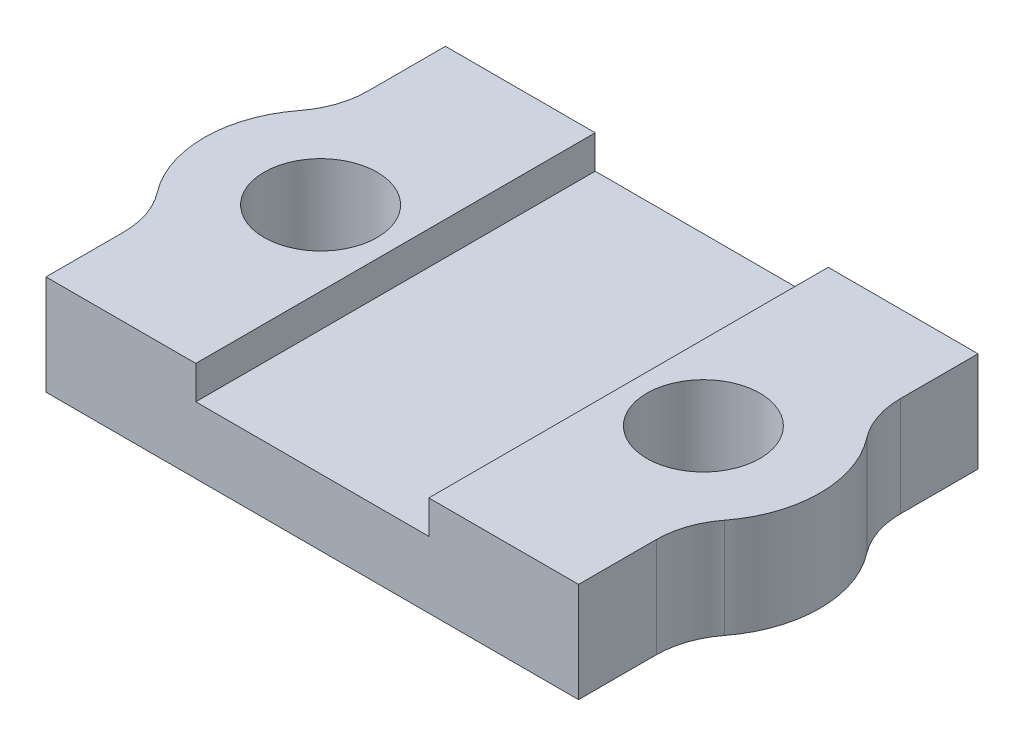
ISO-10303-21;
HEADER;
FILE_DESCRIPTION(('STEP AP214'),'2;1');
FILE_NAME('part.step','',(''),(''),'','','');
FILE_SCHEMA(('AUTOMOTIVE_DESIGN { 1 0 10303 214 1 1 1 1 }'));
ENDSEC;
DATA;
#1=APPLICATION_CONTEXT('core data for automotive mechanical design processes');
#2=APPLICATION_PROTOCOL_DEFINITION('international standard','automotive_design',2000,#1);
#3=PRODUCT_CONTEXT('',#1,'mechanical');
#4=PRODUCT('Part','Part','',(#3));
#5=PRODUCT_RELATED_PRODUCT_CATEGORY('part','',(#4));
#6=PRODUCT_DEFINITION_FORMATION('','',#4);
#7=PRODUCT_DEFINITION_CONTEXT('part definition',#1,'design');
#8=PRODUCT_DEFINITION('design','',#6,#7);
#9=PRODUCT_DEFINITION_SHAPE('','',#8);
#10=(LENGTH_UNIT() NAMED_UNIT(*) SI_UNIT(.MILLI.,.METRE.));
#11=(NAMED_UNIT(*) PLANE_ANGLE_UNIT() SI_UNIT($,.RADIAN.));
#12=(NAMED_UNIT(*) SI_UNIT($,.STERADIAN.) SOLID_ANGLE_UNIT());
#13=UNCERTAINTY_MEASURE_WITH_UNIT(LENGTH_MEASURE(1.E-05),#10,'distance_accuracy_value','');
#14=(GEOMETRIC_REPRESENTATION_CONTEXT(3) GLOBAL_UNCERTAINTY_ASSIGNED_CONTEXT((#13)) GLOBAL_UNIT_ASSIGNED_CONTEXT((#10,
#11,#12)) REPRESENTATION_CONTEXT('',''));
#15=CARTESIAN_POINT('',(0.,0.,0.));
#16=DIRECTION('',(0.,0.,1.));
#17=DIRECTION('',(1.,0.,0.));
#18=AXIS2_PLACEMENT_3D('',#15,#16,#17);
#19=CARTESIAN_POINT('',(10.5,2.,-3.6657195746538));
#20=DIRECTION('',(0.,1.,0.));
#21=DIRECTION('',(0.,0.,1.));
#22=AXIS2_PLACEMENT_3D('',#19,#20,#21);
#23=PLANE('',#22);
#24=DIRECTION('',(0.,0.,1.));
#25=VECTOR('',#24,1.);
#26=CARTESIAN_POINT('',(-3.5,2.,6.00000000000001));
#27=LINE('',#26,#25);
#28=CARTESIAN_POINT('',(-3.5,2.,-5.99999999999999));
#29=VERTEX_POINT('',#28);
#30=CARTESIAN_POINT('',(-3.5,2.,6.00000000000001));
#31=VERTEX_POINT('',#30);
#32=EDGE_CURVE('E170',#29,#31,#27,.T.);
#33=ORIENTED_EDGE('',*,*,#32,.T.);
#34=DIRECTION('',(1.,0.,0.));
#35=VECTOR('',#34,1.);
#36=CARTESIAN_POINT('',(-8.,2.,6.00000000000001));
#37=LINE('',#36,#35);
#38=CARTESIAN_POINT('',(3.5,2.,6.00000000000001));
#39=VERTEX_POINT('',#38);
#40=EDGE_CURVE('E37',#31,#39,#37,.T.);
#41=ORIENTED_EDGE('',*,*,#40,.T.);
#42=DIRECTION('',(0.,0.,1.));
#43=VECTOR('',#42,1.);
#44=CARTESIAN_POINT('',(3.5,2.,6.00000000000001));
#45=LINE('',#44,#43);
#46=CARTESIAN_POINT('',(3.5,2.,-6.));
#47=VERTEX_POINT('',#46);
#48=EDGE_CURVE('E56',#47,#39,#45,.T.);
#49=ORIENTED_EDGE('',*,*,#48,.F.);
#50=DIRECTION('',(-1.,0.,0.));
#51=VECTOR('',#50,1.);
#52=CARTESIAN_POINT('',(-8.,2.,-5.99999999999999));
#53=LINE('',#52,#51);
#54=EDGE_CURVE('E51',#47,#29,#53,.T.);
#55=ORIENTED_EDGE('',*,*,#54,.T.);
#56=EDGE_LOOP('',(#33,#41,#49,#55));
#57=FACE_BOUND('',#56,.T.);
#58=ADVANCED_FACE('F33',(#57),#23,.T.);
#59=CARTESIAN_POINT('',(10.5,0.,-3.6657195746538));
#60=DIRECTION('',(0.,1.,0.));
#61=DIRECTION('',(0.,0.,1.));
#62=AXIS2_PLACEMENT_3D('',#59,#60,#61);
#63=PLANE('',#62);
#64=CARTESIAN_POINT('',(5.75,0.,0.));
#65=DIRECTION('',(0.,1.,0.));
#66=DIRECTION('',(0.,0.,1.));
#67=AXIS2_PLACEMENT_3D('',#64,#65,#66);
#68=CIRCLE('',#67,1.7);
#69=CARTESIAN_POINT('',(5.75,0.,1.7));
#70=VERTEX_POINT('',#69);
#71=EDGE_CURVE('E237',#70,#70,#68,.T.);
#72=ORIENTED_EDGE('',*,*,#71,.T.);
#73=EDGE_LOOP('',(#72));
#74=FACE_BOUND('',#73,.T.);
#75=DIRECTION('',(0.,0.,-1.));
#76=VECTOR('',#75,1.);
#77=CARTESIAN_POINT('',(8.,0.,-6.));
#78=LINE('',#77,#76);
#79=CARTESIAN_POINT('',(8.,0.,-3.6657195746538));
#80=VERTEX_POINT('',#79);
#81=CARTESIAN_POINT('',(8.,0.,-6.));
#82=VERTEX_POINT('',#81);
#83=EDGE_CURVE('E241',#80,#82,#78,.T.);
#84=ORIENTED_EDGE('',*,*,#83,.F.);
#85=CARTESIAN_POINT('',(10.5,0.,-3.6657195746538));
#86=DIRECTION('',(0.,-1.,0.));
#87=DIRECTION('',(0.,0.,1.));
#88=AXIS2_PLACEMENT_3D('',#85,#86,#87);
#89=CIRCLE('',#88,2.5);
#90=CARTESIAN_POINT('',(8.52083333333333,0.,-2.13833641854805));
#91=VERTEX_POINT('',#90);
#92=EDGE_CURVE('E269',#91,#80,#89,.T.);
#93=ORIENTED_EDGE('',*,*,#92,.F.);
#94=CARTESIAN_POINT('',(5.75,0.,0.));
#95=DIRECTION('',(0.,1.,0.));
#96=DIRECTION('',(0.,0.,1.));
#97=AXIS2_PLACEMENT_3D('',#94,#95,#96);
#98=CIRCLE('',#97,3.5);
#99=CARTESIAN_POINT('',(8.52083333333334,0.,2.13833641854805));
#100=VERTEX_POINT('',#99);
#101=EDGE_CURVE('E267',#100,#91,#98,.T.);
#102=ORIENTED_EDGE('',*,*,#101,.F.);
#103=CARTESIAN_POINT('',(10.5,0.,3.6657195746538));
#104=DIRECTION('',(0.,-1.,0.));
#105=DIRECTION('',(0.,0.,-1.));
#106=AXIS2_PLACEMENT_3D('',#103,#104,#105);
#107=CIRCLE('',#106,2.5);
#108=CARTESIAN_POINT('',(8.,0.,3.6657195746538));
#109=VERTEX_POINT('',#108);
#110=EDGE_CURVE('E265',#109,#100,#107,.T.);
#111=ORIENTED_EDGE('',*,*,#110,.F.);
#112=DIRECTION('',(0.,0.,-1.));
#113=VECTOR('',#112,1.);
#114=CARTESIAN_POINT('',(8.,0.,6.));
#115=LINE('',#114,#113);
#116=CARTESIAN_POINT('',(8.,0.,6.));
#117=VERTEX_POINT('',#116);
#118=EDGE_CURVE('E263',#117,#109,#115,.T.);
#119=ORIENTED_EDGE('',*,*,#118,.F.);
#120=DIRECTION('',(1.,0.,0.));
#121=VECTOR('',#120,1.);
#122=CARTESIAN_POINT('',(-8.,0.,6.00000000000001));
#123=LINE('',#122,#121);
#124=CARTESIAN_POINT('',(-8.,0.,6.00000000000001));
#125=VERTEX_POINT('',#124);
#126=EDGE_CURVE('E261',#125,#117,#123,.T.);
#127=ORIENTED_EDGE('',*,*,#126,.F.);
#128=DIRECTION('',(0.,0.,1.));
#129=VECTOR('',#128,1.);
#130=CARTESIAN_POINT('',(-8.,0.,6.00000000000001));
#131=LINE('',#130,#129);
#132=CARTESIAN_POINT('',(-7.99999999999999,0.,3.6657195746538));
#133=VERTEX_POINT('',#132);
#134=EDGE_CURVE('E259',#133,#125,#131,.T.);
#135=ORIENTED_EDGE('',*,*,#134,.F.);
#136=CARTESIAN_POINT('',(-10.5,0.,3.6657195746538));
#137=DIRECTION('',(0.,-1.,0.));
#138=DIRECTION('',(0.,0.,1.));
#139=AXIS2_PLACEMENT_3D('',#136,#137,#138);
#140=CIRCLE('',#139,2.5);
#141=CARTESIAN_POINT('',(-8.52083333333333,0.,2.13833641854806));
#142=VERTEX_POINT('',#141);
#143=EDGE_CURVE('E257',#142,#133,#140,.T.);
#144=ORIENTED_EDGE('',*,*,#143,.F.);
#145=CARTESIAN_POINT('',(-5.74999999999999,0.,0.));
#146=DIRECTION('',(0.,1.,0.));
#147=DIRECTION('',(0.,0.,-1.));
#148=AXIS2_PLACEMENT_3D('',#145,#146,#147);
#149=CIRCLE('',#148,3.5);
#150=CARTESIAN_POINT('',(-8.52083333333333,0.,-2.13833641854803));
#151=VERTEX_POINT('',#150);
#152=EDGE_CURVE('E255',#151,#142,#149,.T.);
#153=ORIENTED_EDGE('',*,*,#152,.F.);
#154=CARTESIAN_POINT('',(-10.5,0.,-3.66571957465378));
#155=DIRECTION('',(0.,-1.,0.));
#156=DIRECTION('',(0.,0.,-1.));
#157=AXIS2_PLACEMENT_3D('',#154,#155,#156);
#158=CIRCLE('',#157,2.5);
#159=CARTESIAN_POINT('',(-8.,0.,-3.66571957465378));
#160=VERTEX_POINT('',#159);
#161=EDGE_CURVE('E253',#160,#151,#158,.T.);
#162=ORIENTED_EDGE('',*,*,#161,.F.);
#163=DIRECTION('',(0.,0.,1.));
#164=VECTOR('',#163,1.);
#165=CARTESIAN_POINT('',(-8.,0.,-5.99999999999999));
#166=LINE('',#165,#164);
#167=CARTESIAN_POINT('',(-8.,0.,-5.99999999999999));
#168=VERTEX_POINT('',#167);
#169=EDGE_CURVE('E251',#168,#160,#166,.T.);
#170=ORIENTED_EDGE('',*,*,#169,.F.);
#171=DIRECTION('',(-1.,0.,0.));
#172=VECTOR('',#171,1.);
#173=CARTESIAN_POINT('',(-8.,0.,-5.99999999999999));
#174=LINE('',#173,#172);
#175=EDGE_CURVE('E245',#82,#168,#174,.T.);
#176=ORIENTED_EDGE('',*,*,#175,.F.);
#177=EDGE_LOOP('',(#84,#93,#102,#111,#119,#127,#135,#144,#153,#162,#170,#176));
#178=FACE_BOUND('',#177,.T.);
#179=CARTESIAN_POINT('',(-5.74999999999999,0.,0.));
#180=DIRECTION('',(0.,1.,0.));
#181=DIRECTION('',(0.,0.,-1.));
#182=AXIS2_PLACEMENT_3D('',#179,#180,#181);
#183=CIRCLE('',#182,1.7);
#184=CARTESIAN_POINT('',(-5.74999999999999,0.,-1.69999999999999));
#185=VERTEX_POINT('',#184);
#186=EDGE_CURVE('E221',#185,#185,#183,.T.);
#187=ORIENTED_EDGE('',*,*,#186,.T.);
#188=EDGE_LOOP('',(#187));
#189=FACE_BOUND('',#188,.T.);
#190=ADVANCED_FACE('F309',(#74,#178,#189),#63,.F.);
#191=CARTESIAN_POINT('',(8.,2.,-6.));
#192=DIRECTION('',(-1.,0.,0.));
#193=DIRECTION('',(0.,0.,1.));
#194=AXIS2_PLACEMENT_3D('',#191,#192,#193);
#195=PLANE('',#194);
#196=ORIENTED_EDGE('',*,*,#83,.T.);
#197=DIRECTION('',(0.,-1.,0.));
#198=VECTOR('',#197,1.);
#199=CARTESIAN_POINT('',(8.,2.,-6.));
#200=LINE('',#199,#198);
#201=CARTESIAN_POINT('',(8.,3.,-6.));
#202=VERTEX_POINT('',#201);
#203=EDGE_CURVE('E11',#202,#82,#200,.T.);
#204=ORIENTED_EDGE('',*,*,#203,.F.);
#205=DIRECTION('',(0.,0.,-1.));
#206=VECTOR('',#205,1.);
#207=CARTESIAN_POINT('',(8.,3.,-3.6657195746538));
#208=LINE('',#207,#206);
#209=CARTESIAN_POINT('',(8.,3.,-3.6657195746538));
#210=VERTEX_POINT('',#209);
#211=EDGE_CURVE('E211',#210,#202,#208,.T.);
#212=ORIENTED_EDGE('',*,*,#211,.F.);
#213=DIRECTION('',(0.,-1.,0.));
#214=VECTOR('',#213,1.);
#215=CARTESIAN_POINT('',(8.,2.,-3.6657195746538));
#216=LINE('',#215,#214);
#217=EDGE_CURVE('E271',#210,#80,#216,.T.);
#218=ORIENTED_EDGE('',*,*,#217,.T.);
#219=EDGE_LOOP('',(#196,#204,#212,#218));
#220=FACE_BOUND('',#219,.T.);
#221=ADVANCED_FACE('F35',(#220),#195,.F.);
#222=CARTESIAN_POINT('',(-8.,2.,-5.99999999999999));
#223=DIRECTION('',(0.,0.,1.));
#224=DIRECTION('',(1.,0.,0.));
#225=AXIS2_PLACEMENT_3D('',#222,#223,#224);
#226=PLANE('',#225);
#227=ORIENTED_EDGE('',*,*,#175,.T.);
#228=DIRECTION('',(0.,-1.,0.));
#229=VECTOR('',#228,1.);
#230=CARTESIAN_POINT('',(-8.,2.,-5.99999999999999));
#231=LINE('',#230,#229);
#232=CARTESIAN_POINT('',(-8.,3.,-6.));
#233=VERTEX_POINT('',#232);
#234=EDGE_CURVE('E43',#233,#168,#231,.T.);
#235=ORIENTED_EDGE('',*,*,#234,.F.);
#236=DIRECTION('',(1.,0.,0.));
#237=VECTOR('',#236,1.);
#238=CARTESIAN_POINT('',(-3.5,3.,-6.));
#239=LINE('',#238,#237);
#240=CARTESIAN_POINT('',(-3.5,3.,-6.));
#241=VERTEX_POINT('',#240);
#242=EDGE_CURVE('E173',#233,#241,#239,.T.);
#243=ORIENTED_EDGE('',*,*,#242,.T.);
#244=DIRECTION('',(0.,-1.,0.));
#245=VECTOR('',#244,1.);
#246=CARTESIAN_POINT('',(-3.5,3.,-6.));
#247=LINE('',#246,#245);
#248=EDGE_CURVE('E159',#241,#29,#247,.T.);
#249=ORIENTED_EDGE('',*,*,#248,.T.);
#250=ORIENTED_EDGE('',*,*,#54,.F.);
#251=DIRECTION('',(0.,-1.,0.));
#252=VECTOR('',#251,1.);
#253=CARTESIAN_POINT('',(3.5,3.,-6.));
#254=LINE('',#253,#252);
#255=CARTESIAN_POINT('',(3.5,3.,-6.));
#256=VERTEX_POINT('',#255);
#257=EDGE_CURVE('E228',#256,#47,#254,.T.);
#258=ORIENTED_EDGE('',*,*,#257,.F.);
#259=DIRECTION('',(-1.,0.,0.));
#260=VECTOR('',#259,1.);
#261=CARTESIAN_POINT('',(3.5,3.,-6.));
#262=LINE('',#261,#260);
#263=EDGE_CURVE('E214',#202,#256,#262,.T.);
#264=ORIENTED_EDGE('',*,*,#263,.F.);
#265=ORIENTED_EDGE('',*,*,#203,.T.);
#266=EDGE_LOOP('',(#227,#235,#243,#249,#250,#258,#264,#265));
#267=FACE_BOUND('',#266,.T.);
#268=ADVANCED_FACE('F380',(#267),#226,.F.);
#269=CARTESIAN_POINT('',(-8.,2.,-5.99999999999999));
#270=DIRECTION('',(1.,0.,0.));
#271=DIRECTION('',(0.,0.,-1.));
#272=AXIS2_PLACEMENT_3D('',#269,#270,#271);
#273=PLANE('',#272);
#274=ORIENTED_EDGE('',*,*,#169,.T.);
#275=DIRECTION('',(0.,-1.,0.));
#276=VECTOR('',#275,1.);
#277=CARTESIAN_POINT('',(-8.,2.,-3.66571957465378));
#278=LINE('',#277,#276);
#279=CARTESIAN_POINT('',(-8.,3.,-3.6657195746538));
#280=VERTEX_POINT('',#279);
#281=EDGE_CURVE('E297',#280,#160,#278,.T.);
#282=ORIENTED_EDGE('',*,*,#281,.F.);
#283=DIRECTION('',(0.,0.,-1.));
#284=VECTOR('',#283,1.);
#285=CARTESIAN_POINT('',(-8.,3.,-3.6657195746538));
#286=LINE('',#285,#284);
#287=EDGE_CURVE('E175',#280,#233,#286,.T.);
#288=ORIENTED_EDGE('',*,*,#287,.T.);
#289=ORIENTED_EDGE('',*,*,#234,.T.);
#290=EDGE_LOOP('',(#274,#282,#288,#289));
#291=FACE_BOUND('',#290,.T.);
#292=ADVANCED_FACE('F303',(#291),#273,.F.);
#293=CARTESIAN_POINT('',(-10.5,2.,-3.66571957465378));
#294=DIRECTION('',(0.,-1.,0.));
#295=DIRECTION('',(0.,0.,-1.));
#296=AXIS2_PLACEMENT_3D('',#293,#294,#295);
#297=CYLINDRICAL_SURFACE('',#296,2.5);
#298=ORIENTED_EDGE('',*,*,#161,.T.);
#299=DIRECTION('',(0.,-1.,0.));
#300=VECTOR('',#299,1.);
#301=CARTESIAN_POINT('',(-8.52083333333333,2.,-2.13833641854803));
#302=LINE('',#301,#300);
#303=CARTESIAN_POINT('',(-8.52083333333333,3.,-2.13833641854805));
#304=VERTEX_POINT('',#303);
#305=EDGE_CURVE('E294',#304,#151,#302,.T.);
#306=ORIENTED_EDGE('',*,*,#305,.F.);
#307=CARTESIAN_POINT('',(-10.5,3.,-3.6657195746538));
#308=DIRECTION('',(0.,1.,0.));
#309=DIRECTION('',(0.,0.,1.));
#310=AXIS2_PLACEMENT_3D('',#307,#308,#309);
#311=CIRCLE('',#310,2.5);
#312=EDGE_CURVE('E181',#304,#280,#311,.T.);
#313=ORIENTED_EDGE('',*,*,#312,.T.);
#314=ORIENTED_EDGE('',*,*,#281,.T.);
#315=EDGE_LOOP('',(#298,#306,#313,#314));
#316=FACE_BOUND('',#315,.T.);
#317=ADVANCED_FACE('F313',(#316),#297,.F.);
#318=CARTESIAN_POINT('',(-5.74999999999999,2.,0.));
#319=DIRECTION('',(0.,-1.,0.));
#320=DIRECTION('',(0.,0.,-1.));
#321=AXIS2_PLACEMENT_3D('',#318,#319,#320);
#322=CYLINDRICAL_SURFACE('',#321,3.5);
#323=ORIENTED_EDGE('',*,*,#152,.T.);
#324=DIRECTION('',(0.,-1.,0.));
#325=VECTOR('',#324,1.);
#326=CARTESIAN_POINT('',(-8.52083333333333,2.,2.13833641854806));
#327=LINE('',#326,#325);
#328=CARTESIAN_POINT('',(-8.52083333333333,3.,2.13833641854805));
#329=VERTEX_POINT('',#328);
#330=EDGE_CURVE('E291',#329,#142,#327,.T.);
#331=ORIENTED_EDGE('',*,*,#330,.F.);
#332=CARTESIAN_POINT('',(-5.75,3.,0.));
#333=DIRECTION('',(0.,-1.,0.));
#334=DIRECTION('',(0.,0.,1.));
#335=AXIS2_PLACEMENT_3D('',#332,#333,#334);
#336=CIRCLE('',#335,3.5);
#337=EDGE_CURVE('E184',#329,#304,#336,.T.);
#338=ORIENTED_EDGE('',*,*,#337,.T.);
#339=ORIENTED_EDGE('',*,*,#305,.T.);
#340=EDGE_LOOP('',(#323,#331,#338,#339));
#341=FACE_BOUND('',#340,.T.);
#342=ADVANCED_FACE('F316',(#341),#322,.T.);
#343=CARTESIAN_POINT('',(-10.5,2.,3.6657195746538));
#344=DIRECTION('',(0.,-1.,0.));
#345=DIRECTION('',(0.,0.,-1.));
#346=AXIS2_PLACEMENT_3D('',#343,#344,#345);
#347=CYLINDRICAL_SURFACE('',#346,2.5);
#348=ORIENTED_EDGE('',*,*,#143,.T.);
#349=DIRECTION('',(0.,-1.,0.));
#350=VECTOR('',#349,1.);
#351=CARTESIAN_POINT('',(-7.99999999999999,2.,3.6657195746538));
#352=LINE('',#351,#350);
#353=CARTESIAN_POINT('',(-8.,3.,3.6657195746538));
#354=VERTEX_POINT('',#353);
#355=EDGE_CURVE('E288',#354,#133,#352,.T.);
#356=ORIENTED_EDGE('',*,*,#355,.F.);
#357=CARTESIAN_POINT('',(-10.5,3.,3.6657195746538));
#358=DIRECTION('',(0.,1.,0.));
#359=DIRECTION('',(0.,0.,1.));
#360=AXIS2_PLACEMENT_3D('',#357,#358,#359);
#361=CIRCLE('',#360,2.5);
#362=EDGE_CURVE('E187',#354,#329,#361,.T.);
#363=ORIENTED_EDGE('',*,*,#362,.T.);
#364=ORIENTED_EDGE('',*,*,#330,.T.);
#365=EDGE_LOOP('',(#348,#356,#363,#364));
#366=FACE_BOUND('',#365,.T.);
#367=ADVANCED_FACE('F319',(#366),#347,.F.);
#368=CARTESIAN_POINT('',(-8.,2.,6.00000000000001));
#369=DIRECTION('',(1.,0.,0.));
#370=DIRECTION('',(0.,0.,-1.));
#371=AXIS2_PLACEMENT_3D('',#368,#369,#370);
#372=PLANE('',#371);
#373=ORIENTED_EDGE('',*,*,#134,.T.);
#374=DIRECTION('',(0.,-1.,0.));
#375=VECTOR('',#374,1.);
#376=CARTESIAN_POINT('',(-8.,2.,6.00000000000001));
#377=LINE('',#376,#375);
#378=CARTESIAN_POINT('',(-8.,3.,6.));
#379=VERTEX_POINT('',#378);
#380=EDGE_CURVE('E286',#379,#125,#377,.T.);
#381=ORIENTED_EDGE('',*,*,#380,.F.);
#382=DIRECTION('',(0.,0.,-1.));
#383=VECTOR('',#382,1.);
#384=CARTESIAN_POINT('',(-8.,3.,6.));
#385=LINE('',#384,#383);
#386=EDGE_CURVE('E169',#379,#354,#385,.T.);
#387=ORIENTED_EDGE('',*,*,#386,.T.);
#388=ORIENTED_EDGE('',*,*,#355,.T.);
#389=EDGE_LOOP('',(#373,#381,#387,#388));
#390=FACE_BOUND('',#389,.T.);
#391=ADVANCED_FACE('F322',(#390),#372,.F.);
#392=CARTESIAN_POINT('',(-8.,2.,6.00000000000001));
#393=DIRECTION('',(0.,0.,-1.));
#394=DIRECTION('',(-1.,0.,0.));
#395=AXIS2_PLACEMENT_3D('',#392,#393,#394);
#396=PLANE('',#395);
#397=ORIENTED_EDGE('',*,*,#126,.T.);
#398=DIRECTION('',(0.,-1.,0.));
#399=VECTOR('',#398,1.);
#400=CARTESIAN_POINT('',(8.,2.,6.));
#401=LINE('',#400,#399);
#402=CARTESIAN_POINT('',(8.,3.,6.));
#403=VERTEX_POINT('',#402);
#404=EDGE_CURVE('E283',#403,#117,#401,.T.);
#405=ORIENTED_EDGE('',*,*,#404,.F.);
#406=DIRECTION('',(1.,0.,0.));
#407=VECTOR('',#406,1.);
#408=CARTESIAN_POINT('',(3.5,3.,6.00000000000001));
#409=LINE('',#408,#407);
#410=CARTESIAN_POINT('',(3.5,3.,6.00000000000001));
#411=VERTEX_POINT('',#410);
#412=EDGE_CURVE('E196',#411,#403,#409,.T.);
#413=ORIENTED_EDGE('',*,*,#412,.F.);
#414=DIRECTION('',(0.,-1.,0.));
#415=VECTOR('',#414,1.);
#416=CARTESIAN_POINT('',(3.5,3.,6.00000000000001));
#417=LINE('',#416,#415);
#418=EDGE_CURVE('E218',#411,#39,#417,.T.);
#419=ORIENTED_EDGE('',*,*,#418,.T.);
#420=ORIENTED_EDGE('',*,*,#40,.F.);
#421=DIRECTION('',(0.,-1.,0.));
#422=VECTOR('',#421,1.);
#423=CARTESIAN_POINT('',(-3.5,3.,6.00000000000001));
#424=LINE('',#423,#422);
#425=CARTESIAN_POINT('',(-3.5,3.,6.00000000000001));
#426=VERTEX_POINT('',#425);
#427=EDGE_CURVE('E148',#426,#31,#424,.T.);
#428=ORIENTED_EDGE('',*,*,#427,.F.);
#429=DIRECTION('',(-1.,0.,0.));
#430=VECTOR('',#429,1.);
#431=CARTESIAN_POINT('',(-3.5,3.,6.00000000000001));
#432=LINE('',#431,#430);
#433=EDGE_CURVE('E152',#426,#379,#432,.T.);
#434=ORIENTED_EDGE('',*,*,#433,.T.);
#435=ORIENTED_EDGE('',*,*,#380,.T.);
#436=EDGE_LOOP('',(#397,#405,#413,#419,#420,#428,#434,#435));
#437=FACE_BOUND('',#436,.T.);
#438=ADVANCED_FACE('F150',(#437),#396,.F.);
#439=CARTESIAN_POINT('',(8.,2.,6.));
#440=DIRECTION('',(-1.,0.,0.));
#441=DIRECTION('',(0.,0.,1.));
#442=AXIS2_PLACEMENT_3D('',#439,#440,#441);
#443=PLANE('',#442);
#444=ORIENTED_EDGE('',*,*,#118,.T.);
#445=DIRECTION('',(0.,-1.,0.));
#446=VECTOR('',#445,1.);
#447=CARTESIAN_POINT('',(8.,2.,3.6657195746538));
#448=LINE('',#447,#446);
#449=CARTESIAN_POINT('',(8.,3.,3.6657195746538));
#450=VERTEX_POINT('',#449);
#451=EDGE_CURVE('E280',#450,#109,#448,.T.);
#452=ORIENTED_EDGE('',*,*,#451,.F.);
#453=DIRECTION('',(0.,0.,-1.));
#454=VECTOR('',#453,1.);
#455=CARTESIAN_POINT('',(8.,3.,6.));
#456=LINE('',#455,#454);
#457=EDGE_CURVE('E199',#403,#450,#456,.T.);
#458=ORIENTED_EDGE('',*,*,#457,.F.);
#459=ORIENTED_EDGE('',*,*,#404,.T.);
#460=EDGE_LOOP('',(#444,#452,#458,#459));
#461=FACE_BOUND('',#460,.T.);
#462=ADVANCED_FACE('F329',(#461),#443,.F.);
#463=CARTESIAN_POINT('',(10.5,2.,3.6657195746538));
#464=DIRECTION('',(0.,-1.,0.));
#465=DIRECTION('',(0.,0.,-1.));
#466=AXIS2_PLACEMENT_3D('',#463,#464,#465);
#467=CYLINDRICAL_SURFACE('',#466,2.5);
#468=ORIENTED_EDGE('',*,*,#110,.T.);
#469=DIRECTION('',(0.,-1.,0.));
#470=VECTOR('',#469,1.);
#471=CARTESIAN_POINT('',(8.52083333333334,2.,2.13833641854805));
#472=LINE('',#471,#470);
#473=CARTESIAN_POINT('',(8.52083333333333,3.,2.13833641854805));
#474=VERTEX_POINT('',#473);
#475=EDGE_CURVE('E277',#474,#100,#472,.T.);
#476=ORIENTED_EDGE('',*,*,#475,.F.);
#477=CARTESIAN_POINT('',(10.5,3.,3.6657195746538));
#478=DIRECTION('',(0.,-1.,0.));
#479=DIRECTION('',(0.,0.,1.));
#480=AXIS2_PLACEMENT_3D('',#477,#478,#479);
#481=CIRCLE('',#480,2.5);
#482=EDGE_CURVE('E202',#450,#474,#481,.T.);
#483=ORIENTED_EDGE('',*,*,#482,.F.);
#484=ORIENTED_EDGE('',*,*,#451,.T.);
#485=EDGE_LOOP('',(#468,#476,#483,#484));
#486=FACE_BOUND('',#485,.T.);
#487=ADVANCED_FACE('F362',(#486),#467,.F.);
#488=CARTESIAN_POINT('',(5.75,2.,0.));
#489=DIRECTION('',(0.,-1.,0.));
#490=DIRECTION('',(0.,0.,-1.));
#491=AXIS2_PLACEMENT_3D('',#488,#489,#490);
#492=CYLINDRICAL_SURFACE('',#491,3.5);
#493=ORIENTED_EDGE('',*,*,#101,.T.);
#494=DIRECTION('',(0.,-1.,0.));
#495=VECTOR('',#494,1.);
#496=CARTESIAN_POINT('',(8.52083333333333,2.,-2.13833641854805));
#497=LINE('',#496,#495);
#498=CARTESIAN_POINT('',(8.52083333333333,3.,-2.13833641854805));
#499=VERTEX_POINT('',#498);
#500=EDGE_CURVE('E274',#499,#91,#497,.T.);
#501=ORIENTED_EDGE('',*,*,#500,.F.);
#502=CARTESIAN_POINT('',(5.75,3.,0.));
#503=DIRECTION('',(0.,1.,0.));
#504=DIRECTION('',(0.,0.,1.));
#505=AXIS2_PLACEMENT_3D('',#502,#503,#504);
#506=CIRCLE('',#505,3.5);
#507=EDGE_CURVE('E205',#474,#499,#506,.T.);
#508=ORIENTED_EDGE('',*,*,#507,.F.);
#509=ORIENTED_EDGE('',*,*,#475,.T.);
#510=EDGE_LOOP('',(#493,#501,#508,#509));
#511=FACE_BOUND('',#510,.T.);
#512=ADVANCED_FACE('F358',(#511),#492,.T.);
#513=CARTESIAN_POINT('',(10.5,2.,-3.6657195746538));
#514=DIRECTION('',(0.,-1.,0.));
#515=DIRECTION('',(0.,0.,-1.));
#516=AXIS2_PLACEMENT_3D('',#513,#514,#515);
#517=CYLINDRICAL_SURFACE('',#516,2.5);
#518=ORIENTED_EDGE('',*,*,#92,.T.);
#519=ORIENTED_EDGE('',*,*,#217,.F.);
#520=CARTESIAN_POINT('',(10.5,3.,-3.6657195746538));
#521=DIRECTION('',(0.,-1.,0.));
#522=DIRECTION('',(0.,0.,1.));
#523=AXIS2_PLACEMENT_3D('',#520,#521,#522);
#524=CIRCLE('',#523,2.5);
#525=EDGE_CURVE('E208',#499,#210,#524,.T.);
#526=ORIENTED_EDGE('',*,*,#525,.F.);
#527=ORIENTED_EDGE('',*,*,#500,.T.);
#528=EDGE_LOOP('',(#518,#519,#526,#527));
#529=FACE_BOUND('',#528,.T.);
#530=ADVANCED_FACE('F355',(#529),#517,.F.);
#531=CARTESIAN_POINT('',(5.75,2.,0.));
#532=DIRECTION('',(0.,-1.,0.));
#533=DIRECTION('',(0.,0.,-1.));
#534=AXIS2_PLACEMENT_3D('',#531,#532,#533);
#535=CYLINDRICAL_SURFACE('',#534,1.7);
#536=ORIENTED_EDGE('',*,*,#71,.F.);
#537=EDGE_LOOP('',(#536));
#538=FACE_BOUND('',#537,.T.);
#539=CARTESIAN_POINT('',(5.75,3.,0.));
#540=DIRECTION('',(0.,1.,0.));
#541=DIRECTION('',(0.,0.,1.));
#542=AXIS2_PLACEMENT_3D('',#539,#540,#541);
#543=CIRCLE('',#542,1.7);
#544=CARTESIAN_POINT('',(5.75,3.,1.7));
#545=VERTEX_POINT('',#544);
#546=EDGE_CURVE('E158',#545,#545,#543,.T.);
#547=ORIENTED_EDGE('',*,*,#546,.T.);
#548=EDGE_LOOP('',(#547));
#549=FACE_BOUND('',#548,.T.);
#550=ADVANCED_FACE('F353',(#538,#549),#535,.F.);
#551=CARTESIAN_POINT('',(-5.74999999999999,2.,0.));
#552=DIRECTION('',(0.,-1.,0.));
#553=DIRECTION('',(0.,0.,-1.));
#554=AXIS2_PLACEMENT_3D('',#551,#552,#553);
#555=CYLINDRICAL_SURFACE('',#554,1.7);
#556=ORIENTED_EDGE('',*,*,#186,.F.);
#557=EDGE_LOOP('',(#556));
#558=FACE_BOUND('',#557,.T.);
#559=CARTESIAN_POINT('',(-5.75,3.,0.));
#560=DIRECTION('',(0.,-1.,0.));
#561=DIRECTION('',(0.,0.,1.));
#562=AXIS2_PLACEMENT_3D('',#559,#560,#561);
#563=CIRCLE('',#562,1.7);
#564=CARTESIAN_POINT('',(-5.75,3.,1.7));
#565=VERTEX_POINT('',#564);
#566=EDGE_CURVE('E192',#565,#565,#563,.T.);
#567=ORIENTED_EDGE('',*,*,#566,.F.);
#568=EDGE_LOOP('',(#567));
#569=FACE_BOUND('',#568,.T.);
#570=ADVANCED_FACE('F343',(#558,#569),#555,.F.);
#571=CARTESIAN_POINT('',(10.5,3.,3.6657195746538));
#572=DIRECTION('',(0.,1.,0.));
#573=DIRECTION('',(0.,0.,1.));
#574=AXIS2_PLACEMENT_3D('',#571,#572,#573);
#575=PLANE('',#574);
#576=ORIENTED_EDGE('',*,*,#412,.T.);
#577=ORIENTED_EDGE('',*,*,#457,.T.);
#578=ORIENTED_EDGE('',*,*,#482,.T.);
#579=ORIENTED_EDGE('',*,*,#507,.T.);
#580=ORIENTED_EDGE('',*,*,#525,.T.);
#581=ORIENTED_EDGE('',*,*,#211,.T.);
#582=ORIENTED_EDGE('',*,*,#263,.T.);
#583=DIRECTION('',(0.,0.,1.));
#584=VECTOR('',#583,1.);
#585=CARTESIAN_POINT('',(3.5,3.,6.00000000000001));
#586=LINE('',#585,#584);
#587=EDGE_CURVE('E216',#256,#411,#586,.T.);
#588=ORIENTED_EDGE('',*,*,#587,.T.);
#589=EDGE_LOOP('',(#576,#577,#578,#579,#580,#581,#582,#588));
#590=FACE_BOUND('',#589,.T.);
#591=ORIENTED_EDGE('',*,*,#546,.F.);
#592=EDGE_LOOP('',(#591));
#593=FACE_BOUND('',#592,.T.);
#594=ADVANCED_FACE('F332',(#590,#593),#575,.T.);
#595=CARTESIAN_POINT('',(3.5,3.,6.00000000000001));
#596=DIRECTION('',(1.,0.,0.));
#597=DIRECTION('',(0.,0.,-1.));
#598=AXIS2_PLACEMENT_3D('',#595,#596,#597);
#599=PLANE('',#598);
#600=ORIENTED_EDGE('',*,*,#48,.T.);
#601=ORIENTED_EDGE('',*,*,#418,.F.);
#602=ORIENTED_EDGE('',*,*,#587,.F.);
#603=ORIENTED_EDGE('',*,*,#257,.T.);
#604=EDGE_LOOP('',(#600,#601,#602,#603));
#605=FACE_BOUND('',#604,.T.);
#606=ADVANCED_FACE('F335',(#605),#599,.F.);
#607=CARTESIAN_POINT('',(-3.5,3.,6.00000000000001));
#608=DIRECTION('',(1.,0.,0.));
#609=DIRECTION('',(0.,0.,-1.));
#610=AXIS2_PLACEMENT_3D('',#607,#608,#609);
#611=PLANE('',#610);
#612=ORIENTED_EDGE('',*,*,#32,.F.);
#613=ORIENTED_EDGE('',*,*,#248,.F.);
#614=DIRECTION('',(0.,0.,1.));
#615=VECTOR('',#614,1.);
#616=CARTESIAN_POINT('',(-3.5,3.,6.00000000000001));
#617=LINE('',#616,#615);
#618=EDGE_CURVE('E165',#241,#426,#617,.T.);
#619=ORIENTED_EDGE('',*,*,#618,.T.);
#620=ORIENTED_EDGE('',*,*,#427,.T.);
#621=EDGE_LOOP('',(#612,#613,#619,#620));
#622=FACE_BOUND('',#621,.T.);
#623=ADVANCED_FACE('F172',(#622),#611,.T.);
#624=CARTESIAN_POINT('',(-10.5,3.,3.6657195746538));
#625=DIRECTION('',(0.,1.,0.));
#626=DIRECTION('',(0.,0.,1.));
#627=AXIS2_PLACEMENT_3D('',#624,#625,#626);
#628=PLANE('',#627);
#629=ORIENTED_EDGE('',*,*,#566,.T.);
#630=EDGE_LOOP('',(#629));
#631=FACE_BOUND('',#630,.T.);
#632=ORIENTED_EDGE('',*,*,#433,.F.);
#633=ORIENTED_EDGE('',*,*,#618,.F.);
#634=ORIENTED_EDGE('',*,*,#242,.F.);
#635=ORIENTED_EDGE('',*,*,#287,.F.);
#636=ORIENTED_EDGE('',*,*,#312,.F.);
#637=ORIENTED_EDGE('',*,*,#337,.F.);
#638=ORIENTED_EDGE('',*,*,#362,.F.);
#639=ORIENTED_EDGE('',*,*,#386,.F.);
#640=EDGE_LOOP('',(#632,#633,#634,#635,#636,#637,#638,#639));
#641=FACE_BOUND('',#640,.T.);
#642=ADVANCED_FACE('F163',(#631,#641),#628,.T.);
#643=CLOSED_SHELL('',(#58,#190,#221,#268,#292,#317,#342,#367,#391,#438,#462,#487,#512,#530,#550,
#570,#594,#606,#623,#642));
#644=MANIFOLD_SOLID_BREP('B2',#643);
#645=ADVANCED_BREP_SHAPE_REPRESENTATION('',(#18,#644),#14);
#646=SHAPE_DEFINITION_REPRESENTATION(#9,#645);
ENDSEC;
END-ISO-10303-21;
